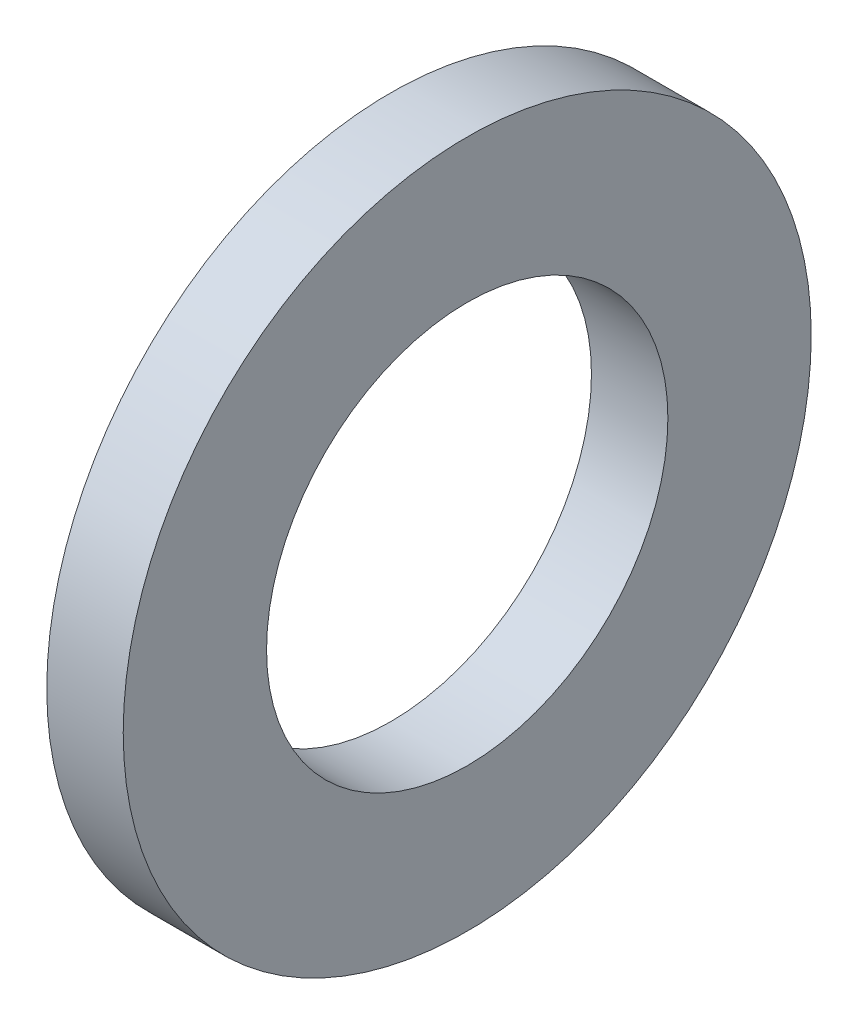
ISO-10303-21;
HEADER;
FILE_DESCRIPTION(('STEP AP214'),'2;1');
FILE_NAME('part.step','',(''),(''),'','','');
FILE_SCHEMA(('AUTOMOTIVE_DESIGN { 1 0 10303 214 1 1 1 1 }'));
ENDSEC;
DATA;
#1=APPLICATION_CONTEXT('core data for automotive mechanical design processes');
#2=APPLICATION_PROTOCOL_DEFINITION('international standard','automotive_design',2000,#1);
#3=PRODUCT_CONTEXT('',#1,'mechanical');
#4=PRODUCT('Part','Part','',(#3));
#5=PRODUCT_RELATED_PRODUCT_CATEGORY('part','',(#4));
#6=PRODUCT_DEFINITION_FORMATION('','',#4);
#7=PRODUCT_DEFINITION_CONTEXT('part definition',#1,'design');
#8=PRODUCT_DEFINITION('design','',#6,#7);
#9=PRODUCT_DEFINITION_SHAPE('','',#8);
#10=(LENGTH_UNIT() NAMED_UNIT(*) SI_UNIT(.MILLI.,.METRE.));
#11=(NAMED_UNIT(*) PLANE_ANGLE_UNIT() SI_UNIT($,.RADIAN.));
#12=(NAMED_UNIT(*) SI_UNIT($,.STERADIAN.) SOLID_ANGLE_UNIT());
#13=UNCERTAINTY_MEASURE_WITH_UNIT(LENGTH_MEASURE(1.E-05),#10,'distance_accuracy_value','');
#14=(GEOMETRIC_REPRESENTATION_CONTEXT(3) GLOBAL_UNCERTAINTY_ASSIGNED_CONTEXT((#13)) GLOBAL_UNIT_ASSIGNED_CONTEXT((#10,
#11,#12)) REPRESENTATION_CONTEXT('',''));
#15=CARTESIAN_POINT('',(0.,0.,0.));
#16=DIRECTION('',(0.,0.,1.));
#17=DIRECTION('',(1.,0.,0.));
#18=AXIS2_PLACEMENT_3D('',#15,#16,#17);
#19=CARTESIAN_POINT('',(-1.,7.12500000000001,0.));
#20=DIRECTION('',(-1.,0.,0.));
#21=DIRECTION('',(0.,0.,1.));
#22=AXIS2_PLACEMENT_3D('',#19,#20,#21);
#23=PLANE('',#22);
#24=CARTESIAN_POINT('',(-1.,0.,0.));
#25=DIRECTION('',(1.,0.,0.));
#26=DIRECTION('',(0.,0.,-1.));
#27=AXIS2_PLACEMENT_3D('',#24,#25,#26);
#28=CIRCLE('',#27,9.);
#29=CARTESIAN_POINT('',(-1.,0.,-9.));
#30=VERTEX_POINT('',#29);
#31=EDGE_CURVE('E19',#30,#30,#28,.T.);
#32=ORIENTED_EDGE('',*,*,#31,.F.);
#33=EDGE_LOOP('',(#32));
#34=FACE_BOUND('',#33,.T.);
#35=CARTESIAN_POINT('',(-1.,0.,0.));
#36=DIRECTION('',(1.,0.,0.));
#37=DIRECTION('',(0.,0.,-1.));
#38=AXIS2_PLACEMENT_3D('',#35,#36,#37);
#39=CIRCLE('',#38,5.25);
#40=CARTESIAN_POINT('',(-1.,0.,-5.25));
#41=VERTEX_POINT('',#40);
#42=EDGE_CURVE('E30',#41,#41,#39,.T.);
#43=ORIENTED_EDGE('',*,*,#42,.T.);
#44=EDGE_LOOP('',(#43));
#45=FACE_BOUND('',#44,.T.);
#46=ADVANCED_FACE('F16',(#34,#45),#23,.T.);
#47=CARTESIAN_POINT('',(0.,0.,0.));
#48=DIRECTION('',(1.,0.,0.));
#49=DIRECTION('',(0.,0.,-1.));
#50=AXIS2_PLACEMENT_3D('',#47,#48,#49);
#51=CYLINDRICAL_SURFACE('',#50,9.);
#52=ORIENTED_EDGE('',*,*,#31,.T.);
#53=EDGE_LOOP('',(#52));
#54=FACE_BOUND('',#53,.T.);
#55=CARTESIAN_POINT('',(1.,0.,0.));
#56=DIRECTION('',(1.,0.,0.));
#57=DIRECTION('',(0.,0.,-1.));
#58=AXIS2_PLACEMENT_3D('',#55,#56,#57);
#59=CIRCLE('',#58,9.);
#60=CARTESIAN_POINT('',(1.,0.,-9.));
#61=VERTEX_POINT('',#60);
#62=EDGE_CURVE('E24',#61,#61,#59,.T.);
#63=ORIENTED_EDGE('',*,*,#62,.F.);
#64=EDGE_LOOP('',(#63));
#65=FACE_BOUND('',#64,.T.);
#66=ADVANCED_FACE('F39',(#54,#65),#51,.T.);
#67=CARTESIAN_POINT('',(0.,0.,0.));
#68=DIRECTION('',(1.,0.,0.));
#69=DIRECTION('',(0.,0.,-1.));
#70=AXIS2_PLACEMENT_3D('',#67,#68,#69);
#71=CYLINDRICAL_SURFACE('',#70,5.25);
#72=CARTESIAN_POINT('',(1.,0.,0.));
#73=DIRECTION('',(1.,0.,0.));
#74=DIRECTION('',(0.,0.,-1.));
#75=AXIS2_PLACEMENT_3D('',#72,#73,#74);
#76=CIRCLE('',#75,5.25);
#77=CARTESIAN_POINT('',(1.,0.,-5.25));
#78=VERTEX_POINT('',#77);
#79=EDGE_CURVE('E10',#78,#78,#76,.F.);
#80=ORIENTED_EDGE('',*,*,#79,.F.);
#81=EDGE_LOOP('',(#80));
#82=FACE_BOUND('',#81,.T.);
#83=ORIENTED_EDGE('',*,*,#42,.F.);
#84=EDGE_LOOP('',(#83));
#85=FACE_BOUND('',#84,.T.);
#86=ADVANCED_FACE('F47',(#82,#85),#71,.F.);
#87=CARTESIAN_POINT('',(1.,7.12500000000001,0.));
#88=DIRECTION('',(1.,0.,0.));
#89=DIRECTION('',(0.,0.,-1.));
#90=AXIS2_PLACEMENT_3D('',#87,#88,#89);
#91=PLANE('',#90);
#92=ORIENTED_EDGE('',*,*,#79,.T.);
#93=EDGE_LOOP('',(#92));
#94=FACE_BOUND('',#93,.T.);
#95=ORIENTED_EDGE('',*,*,#62,.T.);
#96=EDGE_LOOP('',(#95));
#97=FACE_BOUND('',#96,.T.);
#98=ADVANCED_FACE('F48',(#94,#97),#91,.T.);
#99=CLOSED_SHELL('',(#46,#66,#86,#98));
#100=MANIFOLD_SOLID_BREP('B1',#99);
#101=ADVANCED_BREP_SHAPE_REPRESENTATION('',(#18,#100),#14);
#102=SHAPE_DEFINITION_REPRESENTATION(#9,#101);
ENDSEC;
END-ISO-10303-21;
